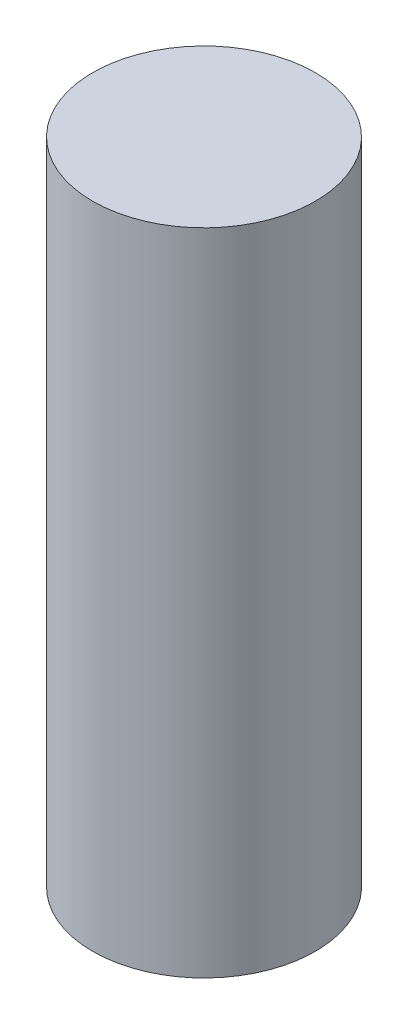
ISO-10303-21;
HEADER;
FILE_DESCRIPTION(('STEP AP214'),'2;1');
FILE_NAME('part.step','',(''),(''),'','','');
FILE_SCHEMA(('AUTOMOTIVE_DESIGN { 1 0 10303 214 1 1 1 1 }'));
ENDSEC;
DATA;
#1=APPLICATION_CONTEXT('core data for automotive mechanical design processes');
#2=APPLICATION_PROTOCOL_DEFINITION('international standard','automotive_design',2000,#1);
#3=PRODUCT_CONTEXT('',#1,'mechanical');
#4=PRODUCT('Part','Part','',(#3));
#5=PRODUCT_RELATED_PRODUCT_CATEGORY('part','',(#4));
#6=PRODUCT_DEFINITION_FORMATION('','',#4);
#7=PRODUCT_DEFINITION_CONTEXT('part definition',#1,'design');
#8=PRODUCT_DEFINITION('design','',#6,#7);
#9=PRODUCT_DEFINITION_SHAPE('','',#8);
#10=(LENGTH_UNIT() NAMED_UNIT(*) SI_UNIT(.MILLI.,.METRE.));
#11=(NAMED_UNIT(*) PLANE_ANGLE_UNIT() SI_UNIT($,.RADIAN.));
#12=(NAMED_UNIT(*) SI_UNIT($,.STERADIAN.) SOLID_ANGLE_UNIT());
#13=UNCERTAINTY_MEASURE_WITH_UNIT(LENGTH_MEASURE(1.E-05),#10,'distance_accuracy_value','');
#14=(GEOMETRIC_REPRESENTATION_CONTEXT(3) GLOBAL_UNCERTAINTY_ASSIGNED_CONTEXT((#13)) GLOBAL_UNIT_ASSIGNED_CONTEXT((#10,
#11,#12)) REPRESENTATION_CONTEXT('',''));
#15=CARTESIAN_POINT('',(0.,0.,0.));
#16=DIRECTION('',(0.,0.,1.));
#17=DIRECTION('',(1.,0.,0.));
#18=AXIS2_PLACEMENT_3D('',#15,#16,#17);
#19=CARTESIAN_POINT('',(0.,35.,0.));
#20=DIRECTION('',(0.,-1.,0.));
#21=DIRECTION('',(0.,0.,-1.));
#22=AXIS2_PLACEMENT_3D('',#19,#20,#21);
#23=CYLINDRICAL_SURFACE('',#22,6.);
#24=CARTESIAN_POINT('',(0.,35.,0.));
#25=DIRECTION('',(0.,1.,0.));
#26=DIRECTION('',(0.,0.,1.));
#27=AXIS2_PLACEMENT_3D('',#24,#25,#26);
#28=CIRCLE('',#27,6.);
#29=CARTESIAN_POINT('',(0.,35.,6.));
#30=VERTEX_POINT('',#29);
#31=EDGE_CURVE('E10',#30,#30,#28,.T.);
#32=ORIENTED_EDGE('',*,*,#31,.F.);
#33=EDGE_LOOP('',(#32));
#34=FACE_BOUND('',#33,.T.);
#35=CARTESIAN_POINT('',(0.,0.,0.));
#36=DIRECTION('',(0.,1.,0.));
#37=DIRECTION('',(0.,0.,1.));
#38=AXIS2_PLACEMENT_3D('',#35,#36,#37);
#39=CIRCLE('',#38,6.);
#40=CARTESIAN_POINT('',(0.,0.,6.));
#41=VERTEX_POINT('',#40);
#42=EDGE_CURVE('E34',#41,#41,#39,.T.);
#43=ORIENTED_EDGE('',*,*,#42,.T.);
#44=EDGE_LOOP('',(#43));
#45=FACE_BOUND('',#44,.T.);
#46=ADVANCED_FACE('F31',(#34,#45),#23,.T.);
#47=CARTESIAN_POINT('',(0.,35.,0.));
#48=DIRECTION('',(0.,1.,0.));
#49=DIRECTION('',(0.,0.,1.));
#50=AXIS2_PLACEMENT_3D('',#47,#48,#49);
#51=PLANE('',#50);
#52=ORIENTED_EDGE('',*,*,#31,.T.);
#53=EDGE_LOOP('',(#52));
#54=FACE_BOUND('',#53,.T.);
#55=ADVANCED_FACE('F46',(#54),#51,.T.);
#56=CARTESIAN_POINT('',(0.,0.,0.));
#57=DIRECTION('',(0.,1.,0.));
#58=DIRECTION('',(0.,0.,1.));
#59=AXIS2_PLACEMENT_3D('',#56,#57,#58);
#60=PLANE('',#59);
#61=ORIENTED_EDGE('',*,*,#42,.F.);
#62=EDGE_LOOP('',(#61));
#63=FACE_BOUND('',#62,.T.);
#64=ADVANCED_FACE('F44',(#63),#60,.F.);
#65=CLOSED_SHELL('',(#46,#55,#64));
#66=MANIFOLD_SOLID_BREP('B2',#65);
#67=ADVANCED_BREP_SHAPE_REPRESENTATION('',(#18,#66),#14);
#68=SHAPE_DEFINITION_REPRESENTATION(#9,#67);
ENDSEC;
END-ISO-10303-21;
